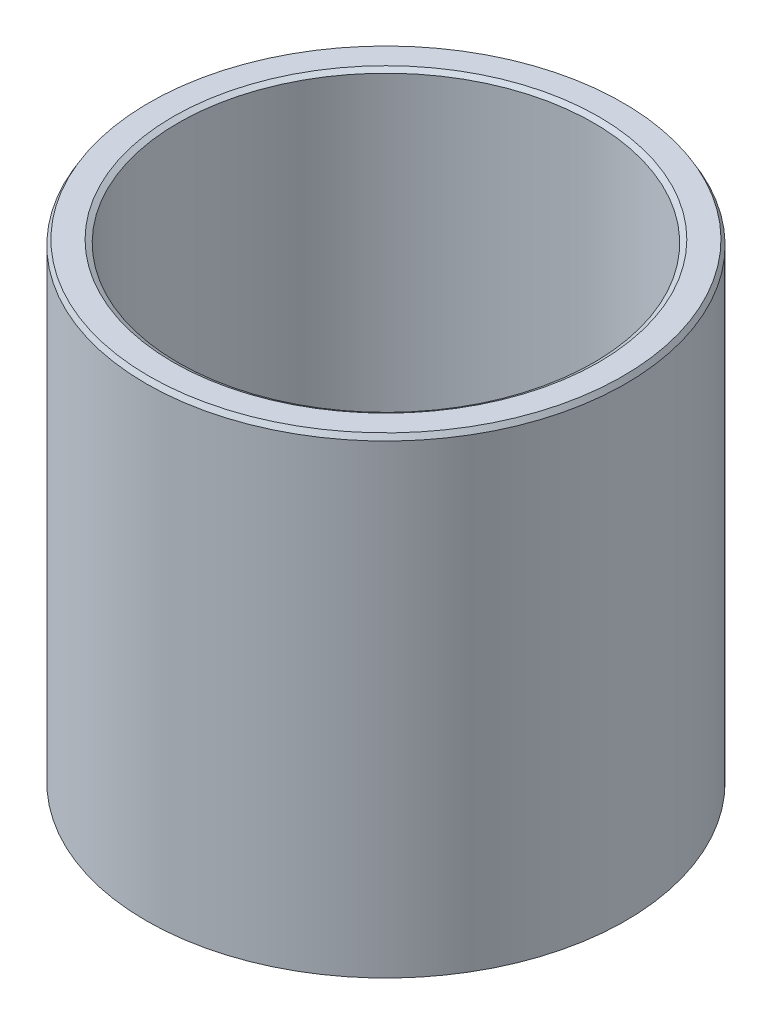
ISO-10303-21;
HEADER;
FILE_DESCRIPTION(('STEP AP214'),'2;1');
FILE_NAME('part.step','',(''),(''),'','','');
FILE_SCHEMA(('AUTOMOTIVE_DESIGN { 1 0 10303 214 1 1 1 1 }'));
ENDSEC;
DATA;
#1=APPLICATION_CONTEXT('core data for automotive mechanical design processes');
#2=APPLICATION_PROTOCOL_DEFINITION('international standard','automotive_design',2000,#1);
#3=PRODUCT_CONTEXT('',#1,'mechanical');
#4=PRODUCT('Part','Part','',(#3));
#5=PRODUCT_RELATED_PRODUCT_CATEGORY('part','',(#4));
#6=PRODUCT_DEFINITION_FORMATION('','',#4);
#7=PRODUCT_DEFINITION_CONTEXT('part definition',#1,'design');
#8=PRODUCT_DEFINITION('design','',#6,#7);
#9=PRODUCT_DEFINITION_SHAPE('','',#8);
#10=(LENGTH_UNIT() NAMED_UNIT(*) SI_UNIT(.MILLI.,.METRE.));
#11=(NAMED_UNIT(*) PLANE_ANGLE_UNIT() SI_UNIT($,.RADIAN.));
#12=(NAMED_UNIT(*) SI_UNIT($,.STERADIAN.) SOLID_ANGLE_UNIT());
#13=UNCERTAINTY_MEASURE_WITH_UNIT(LENGTH_MEASURE(1.E-05),#10,'distance_accuracy_value','');
#14=(GEOMETRIC_REPRESENTATION_CONTEXT(3) GLOBAL_UNCERTAINTY_ASSIGNED_CONTEXT((#13)) GLOBAL_UNIT_ASSIGNED_CONTEXT((#10,
#11,#12)) REPRESENTATION_CONTEXT('',''));
#15=CARTESIAN_POINT('',(0.,0.,0.));
#16=DIRECTION('',(0.,0.,1.));
#17=DIRECTION('',(1.,0.,0.));
#18=AXIS2_PLACEMENT_3D('',#15,#16,#17);
#19=CARTESIAN_POINT('',(0.,113.411064547221,0.));
#20=DIRECTION('',(0.,-1.,0.));
#21=DIRECTION('',(0.,0.,-1.));
#22=AXIS2_PLACEMENT_3D('',#19,#20,#21);
#23=CYLINDRICAL_SURFACE('',#22,57.5);
#24=CARTESIAN_POINT('',(0.,0.69766456398393,0.));
#25=DIRECTION('',(0.,1.,0.));
#26=DIRECTION('',(0.,0.,1.));
#27=AXIS2_PLACEMENT_3D('',#24,#25,#26);
#28=CIRCLE('',#27,57.5);
#29=CARTESIAN_POINT('',(0.,0.69766456398393,57.5));
#30=VERTEX_POINT('',#29);
#31=EDGE_CURVE('E10',#30,#30,#28,.T.);
#32=ORIENTED_EDGE('',*,*,#31,.T.);
#33=EDGE_LOOP('',(#32));
#34=FACE_BOUND('',#33,.T.);
#35=CARTESIAN_POINT('',(0.,112.20267407576,0.));
#36=DIRECTION('',(0.,1.,0.));
#37=DIRECTION('',(0.,0.,1.));
#38=AXIS2_PLACEMENT_3D('',#35,#36,#37);
#39=CIRCLE('',#38,57.5);
#40=CARTESIAN_POINT('',(0.,112.20267407576,57.5));
#41=VERTEX_POINT('',#40);
#42=EDGE_CURVE('E50',#41,#41,#39,.F.);
#43=ORIENTED_EDGE('',*,*,#42,.T.);
#44=EDGE_LOOP('',(#43));
#45=FACE_BOUND('',#44,.T.);
#46=ADVANCED_FACE('F39',(#34,#45),#23,.T.);
#47=CARTESIAN_POINT('',(0.,113.411064547221,0.));
#48=DIRECTION('',(0.,1.,0.));
#49=DIRECTION('',(0.,0.,1.));
#50=AXIS2_PLACEMENT_3D('',#47,#48,#49);
#51=PLANE('',#50);
#52=CARTESIAN_POINT('',(0.,113.411064547221,0.));
#53=DIRECTION('',(0.,1.,0.));
#54=DIRECTION('',(0.,0.,1.));
#55=AXIS2_PLACEMENT_3D('',#52,#53,#54);
#56=CIRCLE('',#55,51.0146031011452);
#57=CARTESIAN_POINT('',(0.,113.411064547221,51.0146031011452));
#58=VERTEX_POINT('',#57);
#59=EDGE_CURVE('E58',#58,#58,#56,.F.);
#60=ORIENTED_EDGE('',*,*,#59,.T.);
#61=EDGE_LOOP('',(#60));
#62=FACE_BOUND('',#61,.T.);
#63=CARTESIAN_POINT('',(0.,113.411064547221,0.));
#64=DIRECTION('',(0.,1.,0.));
#65=DIRECTION('',(0.,0.,1.));
#66=AXIS2_PLACEMENT_3D('',#63,#64,#65);
#67=CIRCLE('',#66,56.8023354360161);
#68=CARTESIAN_POINT('',(0.,113.411064547221,56.8023354360161));
#69=VERTEX_POINT('',#68);
#70=EDGE_CURVE('E61',#69,#69,#67,.T.);
#71=ORIENTED_EDGE('',*,*,#70,.T.);
#72=EDGE_LOOP('',(#71));
#73=FACE_BOUND('',#72,.T.);
#74=ADVANCED_FACE('F88',(#62,#73),#51,.T.);
#75=CARTESIAN_POINT('',(0.,0.,0.));
#76=DIRECTION('',(0.,1.,0.));
#77=DIRECTION('',(0.,0.,1.));
#78=AXIS2_PLACEMENT_3D('',#75,#76,#77);
#79=PLANE('',#78);
#80=CARTESIAN_POINT('',(0.,0.,0.));
#81=DIRECTION('',(0.,1.,0.));
#82=DIRECTION('',(0.,0.,1.));
#83=AXIS2_PLACEMENT_3D('',#80,#81,#82);
#84=CIRCLE('',#83,50.5038771936686);
#85=CARTESIAN_POINT('',(0.,0.,50.5038771936686));
#86=VERTEX_POINT('',#85);
#87=EDGE_CURVE('E51',#86,#86,#84,.T.);
#88=ORIENTED_EDGE('',*,*,#87,.T.);
#89=EDGE_LOOP('',(#88));
#90=FACE_BOUND('',#89,.T.);
#91=CARTESIAN_POINT('',(0.,0.,0.));
#92=DIRECTION('',(0.,1.,0.));
#93=DIRECTION('',(0.,0.,1.));
#94=AXIS2_PLACEMENT_3D('',#91,#92,#93);
#95=CIRCLE('',#94,56.2916095285395);
#96=CARTESIAN_POINT('',(0.,0.,56.2916095285395));
#97=VERTEX_POINT('',#96);
#98=EDGE_CURVE('E54',#97,#97,#95,.F.);
#99=ORIENTED_EDGE('',*,*,#98,.T.);
#100=EDGE_LOOP('',(#99));
#101=FACE_BOUND('',#100,.T.);
#102=ADVANCED_FACE('F83',(#90,#101),#79,.F.);
#103=CARTESIAN_POINT('',(0.,113.411064547221,0.));
#104=DIRECTION('',(0.,-1.,0.));
#105=DIRECTION('',(0.,0.,-1.));
#106=AXIS2_PLACEMENT_3D('',#103,#104,#105);
#107=CYLINDRICAL_SURFACE('',#106,49.8062126296847);
#108=CARTESIAN_POINT('',(0.,112.713399983237,0.));
#109=DIRECTION('',(0.,1.,0.));
#110=DIRECTION('',(0.,0.,1.));
#111=AXIS2_PLACEMENT_3D('',#108,#109,#110);
#112=CIRCLE('',#111,49.8062126296847);
#113=CARTESIAN_POINT('',(0.,112.713399983237,49.8062126296847));
#114=VERTEX_POINT('',#113);
#115=EDGE_CURVE('E67',#114,#114,#112,.T.);
#116=ORIENTED_EDGE('',*,*,#115,.T.);
#117=EDGE_LOOP('',(#116));
#118=FACE_BOUND('',#117,.T.);
#119=CARTESIAN_POINT('',(0.,1.20839047146054,0.));
#120=DIRECTION('',(0.,1.,0.));
#121=DIRECTION('',(0.,0.,1.));
#122=AXIS2_PLACEMENT_3D('',#119,#120,#121);
#123=CIRCLE('',#122,49.8062126296847);
#124=CARTESIAN_POINT('',(0.,1.20839047146054,49.8062126296847));
#125=VERTEX_POINT('',#124);
#126=EDGE_CURVE('E69',#125,#125,#123,.F.);
#127=ORIENTED_EDGE('',*,*,#126,.T.);
#128=EDGE_LOOP('',(#127));
#129=FACE_BOUND('',#128,.T.);
#130=ADVANCED_FACE('F71',(#118,#129),#107,.F.);
#131=CARTESIAN_POINT('',(0.,112.713399983237,0.));
#132=DIRECTION('',(0.,1.,0.));
#133=DIRECTION('',(0.,0.,1.));
#134=AXIS2_PLACEMENT_3D('',#131,#132,#133);
#135=CONICAL_SURFACE('',#134,49.8062126296847,1.04719755119659);
#136=ORIENTED_EDGE('',*,*,#59,.F.);
#137=EDGE_LOOP('',(#136));
#138=FACE_BOUND('',#137,.T.);
#139=ORIENTED_EDGE('',*,*,#115,.F.);
#140=EDGE_LOOP('',(#139));
#141=FACE_BOUND('',#140,.T.);
#142=ADVANCED_FACE('F77',(#138,#141),#135,.F.);
#143=CARTESIAN_POINT('',(0.,0.,0.));
#144=DIRECTION('',(0.,-1.,0.));
#145=DIRECTION('',(0.,0.,-1.));
#146=AXIS2_PLACEMENT_3D('',#143,#144,#145);
#147=CONICAL_SURFACE('',#146,50.5038771936686,0.523598775598291);
#148=ORIENTED_EDGE('',*,*,#126,.F.);
#149=EDGE_LOOP('',(#148));
#150=FACE_BOUND('',#149,.T.);
#151=ORIENTED_EDGE('',*,*,#87,.F.);
#152=EDGE_LOOP('',(#151));
#153=FACE_BOUND('',#152,.T.);
#154=ADVANCED_FACE('F73',(#150,#153),#147,.F.);
#155=CARTESIAN_POINT('',(0.,0.69766456398393,0.));
#156=DIRECTION('',(0.,1.,0.));
#157=DIRECTION('',(0.,0.,1.));
#158=AXIS2_PLACEMENT_3D('',#155,#156,#157);
#159=CONICAL_SURFACE('',#158,57.5,1.04719755119659);
#160=ORIENTED_EDGE('',*,*,#98,.F.);
#161=EDGE_LOOP('',(#160));
#162=FACE_BOUND('',#161,.T.);
#163=ORIENTED_EDGE('',*,*,#31,.F.);
#164=EDGE_LOOP('',(#163));
#165=FACE_BOUND('',#164,.T.);
#166=ADVANCED_FACE('F76',(#162,#165),#159,.T.);
#167=CARTESIAN_POINT('',(0.,113.411064547221,0.));
#168=DIRECTION('',(0.,-1.,0.));
#169=DIRECTION('',(0.,0.,-1.));
#170=AXIS2_PLACEMENT_3D('',#167,#168,#169);
#171=CONICAL_SURFACE('',#170,56.8023354360161,0.523598775598297);
#172=ORIENTED_EDGE('',*,*,#42,.F.);
#173=EDGE_LOOP('',(#172));
#174=FACE_BOUND('',#173,.T.);
#175=ORIENTED_EDGE('',*,*,#70,.F.);
#176=EDGE_LOOP('',(#175));
#177=FACE_BOUND('',#176,.T.);
#178=ADVANCED_FACE('F45',(#174,#177),#171,.T.);
#179=CLOSED_SHELL('',(#46,#74,#102,#130,#142,#154,#166,#178));
#180=MANIFOLD_SOLID_BREP('B2',#179);
#181=ADVANCED_BREP_SHAPE_REPRESENTATION('',(#18,#180),#14);
#182=SHAPE_DEFINITION_REPRESENTATION(#9,#181);
ENDSEC;
END-ISO-10303-21;
